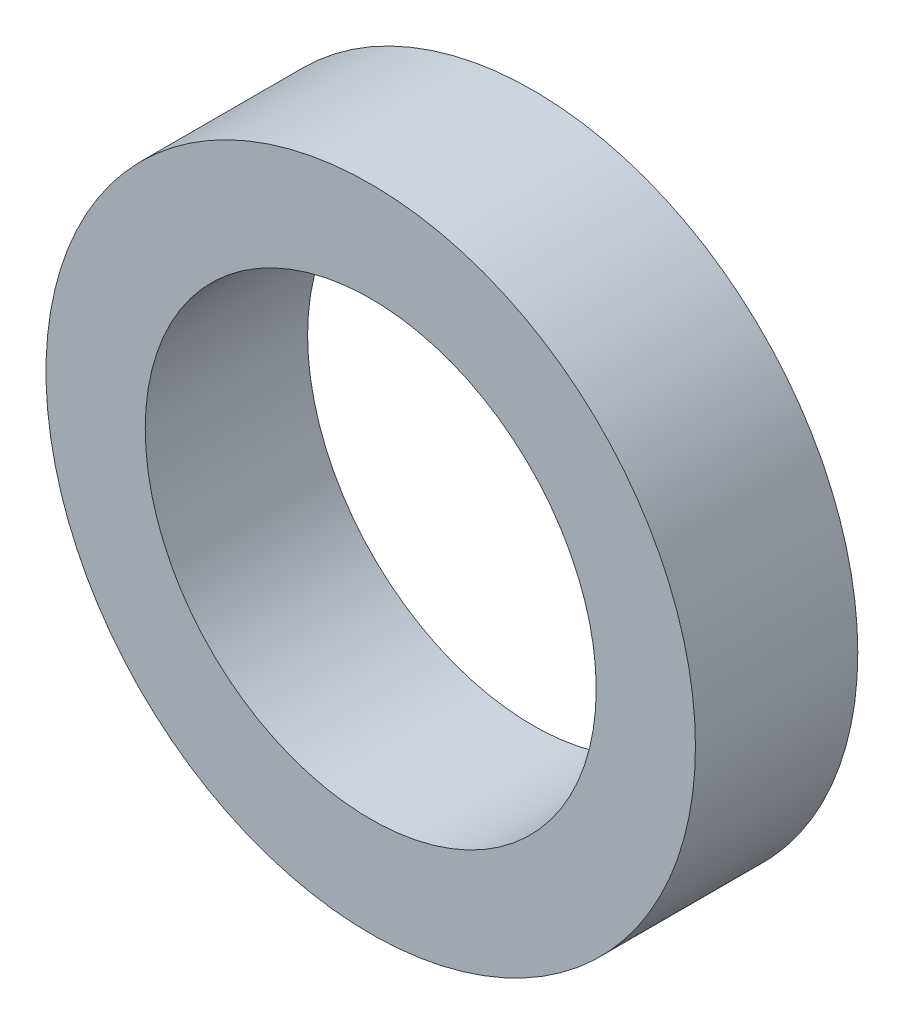
ISO-10303-21;
HEADER;
FILE_DESCRIPTION(('STEP AP214'),'2;1');
FILE_NAME('part.step','',(''),(''),'','','');
FILE_SCHEMA(('AUTOMOTIVE_DESIGN { 1 0 10303 214 1 1 1 1 }'));
ENDSEC;
DATA;
#1=APPLICATION_CONTEXT('core data for automotive mechanical design processes');
#2=APPLICATION_PROTOCOL_DEFINITION('international standard','automotive_design',2000,#1);
#3=PRODUCT_CONTEXT('',#1,'mechanical');
#4=PRODUCT('Part','Part','',(#3));
#5=PRODUCT_RELATED_PRODUCT_CATEGORY('part','',(#4));
#6=PRODUCT_DEFINITION_FORMATION('','',#4);
#7=PRODUCT_DEFINITION_CONTEXT('part definition',#1,'design');
#8=PRODUCT_DEFINITION('design','',#6,#7);
#9=PRODUCT_DEFINITION_SHAPE('','',#8);
#10=(LENGTH_UNIT() NAMED_UNIT(*) SI_UNIT(.MILLI.,.METRE.));
#11=(NAMED_UNIT(*) PLANE_ANGLE_UNIT() SI_UNIT($,.RADIAN.));
#12=(NAMED_UNIT(*) SI_UNIT($,.STERADIAN.) SOLID_ANGLE_UNIT());
#13=UNCERTAINTY_MEASURE_WITH_UNIT(LENGTH_MEASURE(1.E-05),#10,'distance_accuracy_value','');
#14=(GEOMETRIC_REPRESENTATION_CONTEXT(3) GLOBAL_UNCERTAINTY_ASSIGNED_CONTEXT((#13)) GLOBAL_UNIT_ASSIGNED_CONTEXT((#10,
#11,#12)) REPRESENTATION_CONTEXT('',''));
#15=CARTESIAN_POINT('',(0.,0.,0.));
#16=DIRECTION('',(0.,0.,1.));
#17=DIRECTION('',(1.,0.,0.));
#18=AXIS2_PLACEMENT_3D('',#15,#16,#17);
#19=CARTESIAN_POINT('',(0.,0.,4.5));
#20=DIRECTION('',(0.,0.,1.));
#21=DIRECTION('',(1.,0.,0.));
#22=AXIS2_PLACEMENT_3D('',#19,#20,#21);
#23=PLANE('',#22);
#24=CARTESIAN_POINT('',(0.,0.,4.5));
#25=DIRECTION('',(0.,0.,1.));
#26=DIRECTION('',(1.,0.,0.));
#27=AXIS2_PLACEMENT_3D('',#24,#25,#26);
#28=CIRCLE('',#27,9.);
#29=CARTESIAN_POINT('',(9.,0.,4.5));
#30=VERTEX_POINT('',#29);
#31=EDGE_CURVE('E10',#30,#30,#28,.T.);
#32=ORIENTED_EDGE('',*,*,#31,.T.);
#33=EDGE_LOOP('',(#32));
#34=FACE_BOUND('',#33,.T.);
#35=CARTESIAN_POINT('',(0.,0.,4.5));
#36=DIRECTION('',(0.,0.,1.));
#37=DIRECTION('',(1.,0.,0.));
#38=AXIS2_PLACEMENT_3D('',#35,#36,#37);
#39=CIRCLE('',#38,6.25);
#40=CARTESIAN_POINT('',(6.25,0.,4.5));
#41=VERTEX_POINT('',#40);
#42=EDGE_CURVE('E44',#41,#41,#39,.T.);
#43=ORIENTED_EDGE('',*,*,#42,.F.);
#44=EDGE_LOOP('',(#43));
#45=FACE_BOUND('',#44,.T.);
#46=ADVANCED_FACE('F33',(#34,#45),#23,.T.);
#47=CARTESIAN_POINT('',(0.,0.,0.));
#48=DIRECTION('',(0.,0.,1.));
#49=DIRECTION('',(1.,0.,0.));
#50=AXIS2_PLACEMENT_3D('',#47,#48,#49);
#51=PLANE('',#50);
#52=CARTESIAN_POINT('',(0.,0.,0.));
#53=DIRECTION('',(0.,0.,1.));
#54=DIRECTION('',(1.,0.,0.));
#55=AXIS2_PLACEMENT_3D('',#52,#53,#54);
#56=CIRCLE('',#55,9.);
#57=CARTESIAN_POINT('',(9.,0.,0.));
#58=VERTEX_POINT('',#57);
#59=EDGE_CURVE('E37',#58,#58,#56,.T.);
#60=ORIENTED_EDGE('',*,*,#59,.F.);
#61=EDGE_LOOP('',(#60));
#62=FACE_BOUND('',#61,.T.);
#63=CARTESIAN_POINT('',(0.,0.,0.));
#64=DIRECTION('',(0.,0.,1.));
#65=DIRECTION('',(1.,0.,0.));
#66=AXIS2_PLACEMENT_3D('',#63,#64,#65);
#67=CIRCLE('',#66,6.25);
#68=CARTESIAN_POINT('',(6.25,0.,0.));
#69=VERTEX_POINT('',#68);
#70=EDGE_CURVE('E46',#69,#69,#67,.T.);
#71=ORIENTED_EDGE('',*,*,#70,.T.);
#72=EDGE_LOOP('',(#71));
#73=FACE_BOUND('',#72,.T.);
#74=ADVANCED_FACE('F56',(#62,#73),#51,.F.);
#75=CARTESIAN_POINT('',(0.,0.,4.5));
#76=DIRECTION('',(0.,0.,-1.));
#77=DIRECTION('',(-1.,0.,0.));
#78=AXIS2_PLACEMENT_3D('',#75,#76,#77);
#79=CYLINDRICAL_SURFACE('',#78,9.);
#80=ORIENTED_EDGE('',*,*,#31,.F.);
#81=EDGE_LOOP('',(#80));
#82=FACE_BOUND('',#81,.T.);
#83=ORIENTED_EDGE('',*,*,#59,.T.);
#84=EDGE_LOOP('',(#83));
#85=FACE_BOUND('',#84,.T.);
#86=ADVANCED_FACE('F35',(#82,#85),#79,.T.);
#87=CARTESIAN_POINT('',(0.,0.,4.5));
#88=DIRECTION('',(0.,0.,-1.));
#89=DIRECTION('',(-1.,0.,0.));
#90=AXIS2_PLACEMENT_3D('',#87,#88,#89);
#91=CYLINDRICAL_SURFACE('',#90,6.25);
#92=ORIENTED_EDGE('',*,*,#42,.T.);
#93=EDGE_LOOP('',(#92));
#94=FACE_BOUND('',#93,.T.);
#95=ORIENTED_EDGE('',*,*,#70,.F.);
#96=EDGE_LOOP('',(#95));
#97=FACE_BOUND('',#96,.T.);
#98=ADVANCED_FACE('F52',(#94,#97),#91,.F.);
#99=CLOSED_SHELL('',(#46,#74,#86,#98));
#100=MANIFOLD_SOLID_BREP('B2',#99);
#101=ADVANCED_BREP_SHAPE_REPRESENTATION('',(#18,#100),#14);
#102=SHAPE_DEFINITION_REPRESENTATION(#9,#101);
ENDSEC;
END-ISO-10303-21;
